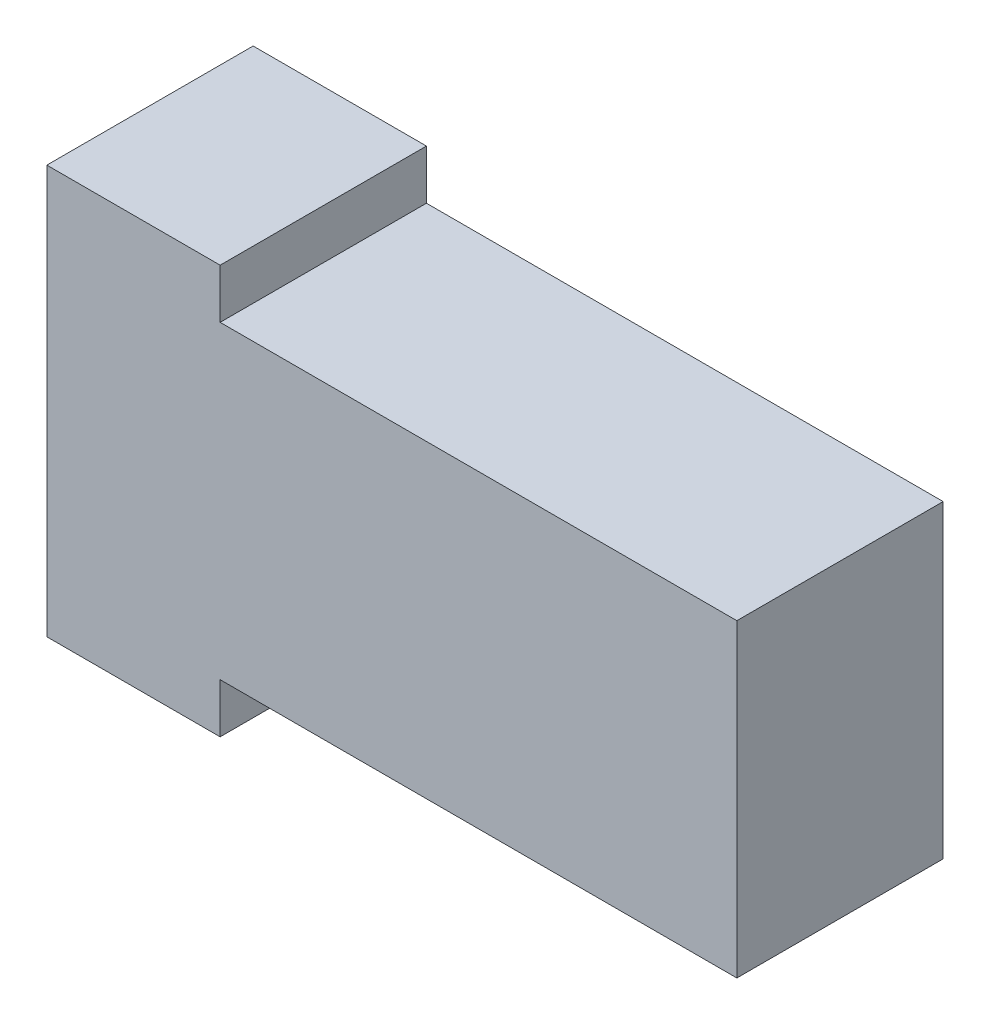
ISO-10303-21;
HEADER;
FILE_DESCRIPTION(('STEP AP214'),'2;1');
FILE_NAME('part.step','',(''),(''),'','','');
FILE_SCHEMA(('AUTOMOTIVE_DESIGN { 1 0 10303 214 1 1 1 1 }'));
ENDSEC;
DATA;
#1=APPLICATION_CONTEXT('core data for automotive mechanical design processes');
#2=APPLICATION_PROTOCOL_DEFINITION('international standard','automotive_design',2000,#1);
#3=PRODUCT_CONTEXT('',#1,'mechanical');
#4=PRODUCT('Part','Part','',(#3));
#5=PRODUCT_RELATED_PRODUCT_CATEGORY('part','',(#4));
#6=PRODUCT_DEFINITION_FORMATION('','',#4);
#7=PRODUCT_DEFINITION_CONTEXT('part definition',#1,'design');
#8=PRODUCT_DEFINITION('design','',#6,#7);
#9=PRODUCT_DEFINITION_SHAPE('','',#8);
#10=(LENGTH_UNIT() NAMED_UNIT(*) SI_UNIT(.MILLI.,.METRE.));
#11=(NAMED_UNIT(*) PLANE_ANGLE_UNIT() SI_UNIT($,.RADIAN.));
#12=(NAMED_UNIT(*) SI_UNIT($,.STERADIAN.) SOLID_ANGLE_UNIT());
#13=UNCERTAINTY_MEASURE_WITH_UNIT(LENGTH_MEASURE(1.E-05),#10,'distance_accuracy_value','');
#14=(GEOMETRIC_REPRESENTATION_CONTEXT(3) GLOBAL_UNCERTAINTY_ASSIGNED_CONTEXT((#13)) GLOBAL_UNIT_ASSIGNED_CONTEXT((#10,
#11,#12)) REPRESENTATION_CONTEXT('',''));
#15=CARTESIAN_POINT('',(0.,0.,0.));
#16=DIRECTION('',(0.,0.,1.));
#17=DIRECTION('',(1.,0.,0.));
#18=AXIS2_PLACEMENT_3D('',#15,#16,#17);
#19=CARTESIAN_POINT('',(195.3553175894,101.90704329235,113.086328634145));
#20=DIRECTION('',(0.,1.,0.));
#21=DIRECTION('',(1.,0.,0.));
#22=AXIS2_PLACEMENT_3D('',#19,#20,#21);
#23=PLANE('',#22);
#24=DIRECTION('',(0.,0.,-1.));
#25=VECTOR('',#24,1.);
#26=CARTESIAN_POINT('',(195.956744279938,101.90704329235,112.648955771372));
#27=LINE('',#26,#25);
#28=CARTESIAN_POINT('',(195.956744279938,101.90704329235,113.651470551509));
#29=VERTEX_POINT('',#28);
#30=CARTESIAN_POINT('',(195.956744279938,101.90704329235,113.151470551509));
#31=VERTEX_POINT('',#30);
#32=EDGE_CURVE('E64',#29,#31,#27,.T.);
#33=ORIENTED_EDGE('',*,*,#32,.F.);
#34=DIRECTION('',(1.,0.,0.));
#35=VECTOR('',#34,1.);
#36=CARTESIAN_POINT('',(195.209042943722,101.90704329235,113.651470551509));
#37=LINE('',#36,#35);
#38=CARTESIAN_POINT('',(197.209042943722,101.90704329235,113.651470551509));
#39=VERTEX_POINT('',#38);
#40=EDGE_CURVE('E11',#29,#39,#37,.T.);
#41=ORIENTED_EDGE('',*,*,#40,.T.);
#42=DIRECTION('',(0.,0.,-1.));
#43=VECTOR('',#42,1.);
#44=CARTESIAN_POINT('',(197.209042943722,101.90704329235,113.651470551509));
#45=LINE('',#44,#43);
#46=CARTESIAN_POINT('',(197.209042943722,101.90704329235,113.151470551509));
#47=VERTEX_POINT('',#46);
#48=EDGE_CURVE('E54',#39,#47,#45,.T.);
#49=ORIENTED_EDGE('',*,*,#48,.T.);
#50=DIRECTION('',(-1.,0.,0.));
#51=VECTOR('',#50,1.);
#52=CARTESIAN_POINT('',(197.209042943722,101.90704329235,113.151470551509));
#53=LINE('',#52,#51);
#54=EDGE_CURVE('E319',#47,#31,#53,.T.);
#55=ORIENTED_EDGE('',*,*,#54,.T.);
#56=EDGE_LOOP('',(#33,#41,#49,#55));
#57=FACE_BOUND('',#56,.T.);
#58=ADVANCED_FACE('F44',(#57),#23,.T.);
#59=CARTESIAN_POINT('',(197.209042943722,101.90704329235,113.651470551509));
#60=DIRECTION('',(1.,0.,0.));
#61=DIRECTION('',(0.,1.,0.));
#62=AXIS2_PLACEMENT_3D('',#59,#60,#61);
#63=PLANE('',#62);
#64=DIRECTION('',(0.,-1.,0.));
#65=VECTOR('',#64,1.);
#66=CARTESIAN_POINT('',(197.209042943722,101.90704329235,113.651470551509));
#67=LINE('',#66,#65);
#68=CARTESIAN_POINT('',(197.209042943722,101.15704329235,113.651470551509));
#69=VERTEX_POINT('',#68);
#70=EDGE_CURVE('E316',#39,#69,#67,.T.);
#71=ORIENTED_EDGE('',*,*,#70,.T.);
#72=DIRECTION('',(0.,0.,-1.));
#73=VECTOR('',#72,1.);
#74=CARTESIAN_POINT('',(197.209042943722,101.15704329235,113.651470551509));
#75=LINE('',#74,#73);
#76=CARTESIAN_POINT('',(197.209042943722,101.15704329235,113.151470551509));
#77=VERTEX_POINT('',#76);
#78=EDGE_CURVE('E309',#69,#77,#75,.T.);
#79=ORIENTED_EDGE('',*,*,#78,.T.);
#80=DIRECTION('',(0.,-1.,0.));
#81=VECTOR('',#80,1.);
#82=CARTESIAN_POINT('',(197.209042943722,101.90704329235,113.151470551509));
#83=LINE('',#82,#81);
#84=EDGE_CURVE('E335',#47,#77,#83,.T.);
#85=ORIENTED_EDGE('',*,*,#84,.F.);
#86=ORIENTED_EDGE('',*,*,#48,.F.);
#87=EDGE_LOOP('',(#71,#79,#85,#86));
#88=FACE_BOUND('',#87,.T.);
#89=ADVANCED_FACE('F179',(#88),#63,.T.);
#90=CARTESIAN_POINT('',(195.3553175894,101.15704329235,113.086328634145));
#91=DIRECTION('',(0.,1.,0.));
#92=DIRECTION('',(1.,0.,0.));
#93=AXIS2_PLACEMENT_3D('',#90,#91,#92);
#94=PLANE('',#93);
#95=DIRECTION('',(-1.,0.,0.));
#96=VECTOR('',#95,1.);
#97=CARTESIAN_POINT('',(197.209042943722,101.15704329235,113.151470551509));
#98=LINE('',#97,#96);
#99=CARTESIAN_POINT('',(195.956744279938,101.15704329235,113.151470551509));
#100=VERTEX_POINT('',#99);
#101=EDGE_CURVE('E279',#77,#100,#98,.T.);
#102=ORIENTED_EDGE('',*,*,#101,.F.);
#103=ORIENTED_EDGE('',*,*,#78,.F.);
#104=DIRECTION('',(1.,0.,0.));
#105=VECTOR('',#104,1.);
#106=CARTESIAN_POINT('',(195.209042943722,101.15704329235,113.651470551509));
#107=LINE('',#106,#105);
#108=CARTESIAN_POINT('',(195.956744279938,101.15704329235,113.651470551509));
#109=VERTEX_POINT('',#108);
#110=EDGE_CURVE('E302',#109,#69,#107,.T.);
#111=ORIENTED_EDGE('',*,*,#110,.F.);
#112=DIRECTION('',(0.,0.,-1.));
#113=VECTOR('',#112,1.);
#114=CARTESIAN_POINT('',(195.956744279938,101.15704329235,112.648955771372));
#115=LINE('',#114,#113);
#116=EDGE_CURVE('E290',#109,#100,#115,.T.);
#117=ORIENTED_EDGE('',*,*,#116,.T.);
#118=EDGE_LOOP('',(#102,#103,#111,#117));
#119=FACE_BOUND('',#118,.T.);
#120=ADVANCED_FACE('F187',(#119),#94,.F.);
#121=CARTESIAN_POINT('',(195.956744279938,104.78204329235,112.211582908599));
#122=DIRECTION('',(1.,0.,0.));
#123=DIRECTION('',(0.,1.,0.));
#124=AXIS2_PLACEMENT_3D('',#121,#122,#123);
#125=PLANE('',#124);
#126=ORIENTED_EDGE('',*,*,#116,.F.);
#127=DIRECTION('',(0.,1.,0.));
#128=VECTOR('',#127,1.);
#129=CARTESIAN_POINT('',(195.956744279938,103.40454329235,113.651470551509));
#130=LINE('',#129,#128);
#131=CARTESIAN_POINT('',(195.956744279938,101.03704329235,113.651470551509));
#132=VERTEX_POINT('',#131);
#133=EDGE_CURVE('E287',#132,#109,#130,.T.);
#134=ORIENTED_EDGE('',*,*,#133,.F.);
#135=DIRECTION('',(0.,0.,-1.));
#136=VECTOR('',#135,1.);
#137=CARTESIAN_POINT('',(195.956744279938,101.03704329235,112.648955771372));
#138=LINE('',#137,#136);
#139=CARTESIAN_POINT('',(195.956744279938,101.03704329235,113.151470551509));
#140=VERTEX_POINT('',#139);
#141=EDGE_CURVE('E285',#132,#140,#138,.T.);
#142=ORIENTED_EDGE('',*,*,#141,.T.);
#143=DIRECTION('',(0.,-1.,0.));
#144=VECTOR('',#143,1.);
#145=CARTESIAN_POINT('',(195.956744279938,103.40454329235,113.151470551509));
#146=LINE('',#145,#144);
#147=EDGE_CURVE('E276',#100,#140,#146,.T.);
#148=ORIENTED_EDGE('',*,*,#147,.F.);
#149=EDGE_LOOP('',(#126,#134,#142,#148));
#150=FACE_BOUND('',#149,.T.);
#151=ADVANCED_FACE('F192',(#150),#125,.T.);
#152=CARTESIAN_POINT('',(195.3553175894,101.03704329235,113.086328634145));
#153=DIRECTION('',(0.,1.,0.));
#154=DIRECTION('',(1.,0.,0.));
#155=AXIS2_PLACEMENT_3D('',#152,#153,#154);
#156=PLANE('',#155);
#157=ORIENTED_EDGE('',*,*,#141,.F.);
#158=DIRECTION('',(1.,0.,0.));
#159=VECTOR('',#158,1.);
#160=CARTESIAN_POINT('',(195.209042943722,101.03704329235,113.651470551509));
#161=LINE('',#160,#159);
#162=CARTESIAN_POINT('',(195.536744279938,101.03704329235,113.651470551509));
#163=VERTEX_POINT('',#162);
#164=EDGE_CURVE('E311',#163,#132,#161,.T.);
#165=ORIENTED_EDGE('',*,*,#164,.F.);
#166=DIRECTION('',(0.,0.,1.));
#167=VECTOR('',#166,1.);
#168=CARTESIAN_POINT('',(195.536744279938,101.03704329235,112.211582908599));
#169=LINE('',#168,#167);
#170=CARTESIAN_POINT('',(195.536744279938,101.03704329235,113.151470551509));
#171=VERTEX_POINT('',#170);
#172=EDGE_CURVE('E291',#171,#163,#169,.T.);
#173=ORIENTED_EDGE('',*,*,#172,.F.);
#174=DIRECTION('',(-1.,0.,0.));
#175=VECTOR('',#174,1.);
#176=CARTESIAN_POINT('',(197.209042943722,101.03704329235,113.151470551509));
#177=LINE('',#176,#175);
#178=EDGE_CURVE('E147',#140,#171,#177,.T.);
#179=ORIENTED_EDGE('',*,*,#178,.F.);
#180=EDGE_LOOP('',(#157,#165,#173,#179));
#181=FACE_BOUND('',#180,.T.);
#182=ADVANCED_FACE('F166',(#181),#156,.F.);
#183=CARTESIAN_POINT('',(195.536744279938,101.03704329235,112.211582908599));
#184=DIRECTION('',(-1.,0.,0.));
#185=DIRECTION('',(0.,0.,1.));
#186=AXIS2_PLACEMENT_3D('',#183,#184,#185);
#187=PLANE('',#186);
#188=DIRECTION('',(0.,1.,0.));
#189=VECTOR('',#188,1.);
#190=CARTESIAN_POINT('',(195.536744279938,101.53204329235,113.151470551509));
#191=LINE('',#190,#189);
#192=CARTESIAN_POINT('',(195.536744279938,102.02704329235,113.151470551509));
#193=VERTEX_POINT('',#192);
#194=EDGE_CURVE('E134',#171,#193,#191,.T.);
#195=ORIENTED_EDGE('',*,*,#194,.F.);
#196=ORIENTED_EDGE('',*,*,#172,.T.);
#197=DIRECTION('',(0.,-1.,0.));
#198=VECTOR('',#197,1.);
#199=CARTESIAN_POINT('',(195.536744279938,101.53204329235,113.651470551509));
#200=LINE('',#199,#198);
#201=CARTESIAN_POINT('',(195.536744279938,102.02704329235,113.651470551509));
#202=VERTEX_POINT('',#201);
#203=EDGE_CURVE('E136',#202,#163,#200,.T.);
#204=ORIENTED_EDGE('',*,*,#203,.F.);
#205=DIRECTION('',(0.,0.,1.));
#206=VECTOR('',#205,1.);
#207=CARTESIAN_POINT('',(195.536744279938,102.02704329235,112.211582908599));
#208=LINE('',#207,#206);
#209=EDGE_CURVE('E125',#193,#202,#208,.T.);
#210=ORIENTED_EDGE('',*,*,#209,.F.);
#211=EDGE_LOOP('',(#195,#196,#204,#210));
#212=FACE_BOUND('',#211,.T.);
#213=ADVANCED_FACE('F132',(#212),#187,.T.);
#214=CARTESIAN_POINT('',(195.209042943722,102.02704329235,113.651470551509));
#215=DIRECTION('',(0.,0.,1.));
#216=DIRECTION('',(1.,0.,0.));
#217=AXIS2_PLACEMENT_3D('',#214,#215,#216);
#218=PLANE('',#217);
#219=DIRECTION('',(1.,0.,0.));
#220=VECTOR('',#219,1.);
#221=CARTESIAN_POINT('',(195.209042943722,102.02704329235,113.651470551509));
#222=LINE('',#221,#220);
#223=CARTESIAN_POINT('',(195.956744279938,102.02704329235,113.651470551509));
#224=VERTEX_POINT('',#223);
#225=EDGE_CURVE('E139',#202,#224,#222,.T.);
#226=ORIENTED_EDGE('',*,*,#225,.F.);
#227=ORIENTED_EDGE('',*,*,#203,.T.);
#228=ORIENTED_EDGE('',*,*,#164,.T.);
#229=ORIENTED_EDGE('',*,*,#133,.T.);
#230=ORIENTED_EDGE('',*,*,#110,.T.);
#231=ORIENTED_EDGE('',*,*,#70,.F.);
#232=ORIENTED_EDGE('',*,*,#40,.F.);
#233=DIRECTION('',(0.,1.,0.));
#234=VECTOR('',#233,1.);
#235=CARTESIAN_POINT('',(195.956744279938,103.40454329235,113.651470551509));
#236=LINE('',#235,#234);
#237=EDGE_CURVE('E304',#29,#224,#236,.T.);
#238=ORIENTED_EDGE('',*,*,#237,.T.);
#239=EDGE_LOOP('',(#226,#227,#228,#229,#230,#231,#232,#238));
#240=FACE_BOUND('',#239,.T.);
#241=ADVANCED_FACE('F165',(#240),#218,.T.);
#242=CARTESIAN_POINT('',(195.956744279938,104.78204329235,112.211582908599));
#243=DIRECTION('',(1.,0.,0.));
#244=DIRECTION('',(0.,1.,0.));
#245=AXIS2_PLACEMENT_3D('',#242,#243,#244);
#246=PLANE('',#245);
#247=DIRECTION('',(0.,0.,-1.));
#248=VECTOR('',#247,1.);
#249=CARTESIAN_POINT('',(195.956744279938,102.02704329235,112.648955771372));
#250=LINE('',#249,#248);
#251=CARTESIAN_POINT('',(195.956744279938,102.02704329235,113.151470551509));
#252=VERTEX_POINT('',#251);
#253=EDGE_CURVE('E152',#224,#252,#250,.T.);
#254=ORIENTED_EDGE('',*,*,#253,.F.);
#255=ORIENTED_EDGE('',*,*,#237,.F.);
#256=ORIENTED_EDGE('',*,*,#32,.T.);
#257=DIRECTION('',(0.,-1.,0.));
#258=VECTOR('',#257,1.);
#259=CARTESIAN_POINT('',(195.956744279938,103.40454329235,113.151470551509));
#260=LINE('',#259,#258);
#261=EDGE_CURVE('E300',#252,#31,#260,.T.);
#262=ORIENTED_EDGE('',*,*,#261,.F.);
#263=EDGE_LOOP('',(#254,#255,#256,#262));
#264=FACE_BOUND('',#263,.T.);
#265=ADVANCED_FACE('F212',(#264),#246,.T.);
#266=CARTESIAN_POINT('',(197.209042943722,102.02704329235,113.151470551509));
#267=DIRECTION('',(0.,0.,-1.));
#268=DIRECTION('',(-1.,0.,0.));
#269=AXIS2_PLACEMENT_3D('',#266,#267,#268);
#270=PLANE('',#269);
#271=DIRECTION('',(-1.,0.,0.));
#272=VECTOR('',#271,1.);
#273=CARTESIAN_POINT('',(197.209042943722,102.02704329235,113.151470551509));
#274=LINE('',#273,#272);
#275=EDGE_CURVE('E48',#252,#193,#274,.T.);
#276=ORIENTED_EDGE('',*,*,#275,.F.);
#277=ORIENTED_EDGE('',*,*,#261,.T.);
#278=ORIENTED_EDGE('',*,*,#54,.F.);
#279=ORIENTED_EDGE('',*,*,#84,.T.);
#280=ORIENTED_EDGE('',*,*,#101,.T.);
#281=ORIENTED_EDGE('',*,*,#147,.T.);
#282=ORIENTED_EDGE('',*,*,#178,.T.);
#283=ORIENTED_EDGE('',*,*,#194,.T.);
#284=EDGE_LOOP('',(#276,#277,#278,#279,#280,#281,#282,#283));
#285=FACE_BOUND('',#284,.T.);
#286=ADVANCED_FACE('F143',(#285),#270,.T.);
#287=CARTESIAN_POINT('',(195.3553175894,102.02704329235,113.086328634145));
#288=DIRECTION('',(0.,1.,0.));
#289=DIRECTION('',(1.,0.,0.));
#290=AXIS2_PLACEMENT_3D('',#287,#288,#289);
#291=PLANE('',#290);
#292=ORIENTED_EDGE('',*,*,#275,.T.);
#293=ORIENTED_EDGE('',*,*,#209,.T.);
#294=ORIENTED_EDGE('',*,*,#225,.T.);
#295=ORIENTED_EDGE('',*,*,#253,.T.);
#296=EDGE_LOOP('',(#292,#293,#294,#295));
#297=FACE_BOUND('',#296,.T.);
#298=ADVANCED_FACE('F46',(#297),#291,.T.);
#299=CLOSED_SHELL('',(#58,#89,#120,#151,#182,#213,#241,#265,#286,#298));
#300=MANIFOLD_SOLID_BREP('B2',#299);
#301=ADVANCED_BREP_SHAPE_REPRESENTATION('',(#18,#300),#14);
#302=SHAPE_DEFINITION_REPRESENTATION(#9,#301);
ENDSEC;
END-ISO-10303-21;
